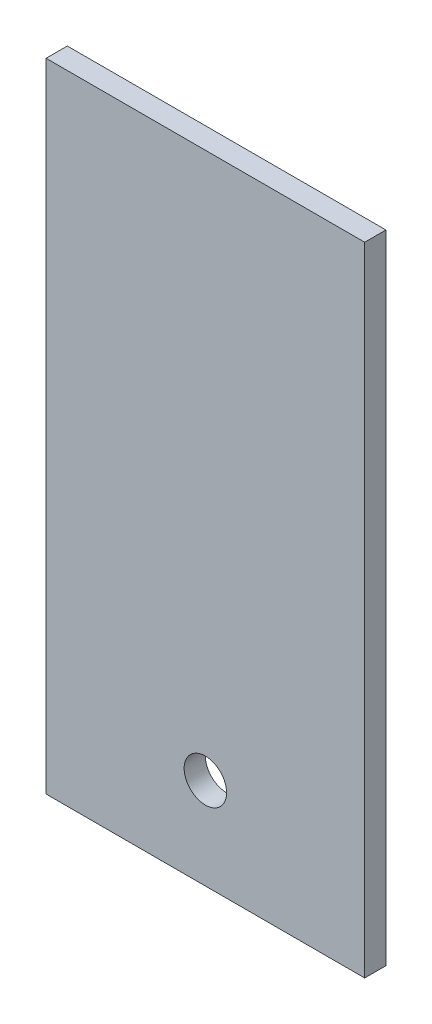
ISO-10303-21;
HEADER;
FILE_DESCRIPTION(('STEP AP214'),'2;1');
FILE_NAME('part.step','',(''),(''),'','','');
FILE_SCHEMA(('AUTOMOTIVE_DESIGN { 1 0 10303 214 1 1 1 1 }'));
ENDSEC;
DATA;
#1=APPLICATION_CONTEXT('core data for automotive mechanical design processes');
#2=APPLICATION_PROTOCOL_DEFINITION('international standard','automotive_design',2000,#1);
#3=PRODUCT_CONTEXT('',#1,'mechanical');
#4=PRODUCT('Part','Part','',(#3));
#5=PRODUCT_RELATED_PRODUCT_CATEGORY('part','',(#4));
#6=PRODUCT_DEFINITION_FORMATION('','',#4);
#7=PRODUCT_DEFINITION_CONTEXT('part definition',#1,'design');
#8=PRODUCT_DEFINITION('design','',#6,#7);
#9=PRODUCT_DEFINITION_SHAPE('','',#8);
#10=(LENGTH_UNIT() NAMED_UNIT(*) SI_UNIT(.MILLI.,.METRE.));
#11=(NAMED_UNIT(*) PLANE_ANGLE_UNIT() SI_UNIT($,.RADIAN.));
#12=(NAMED_UNIT(*) SI_UNIT($,.STERADIAN.) SOLID_ANGLE_UNIT());
#13=UNCERTAINTY_MEASURE_WITH_UNIT(LENGTH_MEASURE(1.E-05),#10,'distance_accuracy_value','');
#14=(GEOMETRIC_REPRESENTATION_CONTEXT(3) GLOBAL_UNCERTAINTY_ASSIGNED_CONTEXT((#13)) GLOBAL_UNIT_ASSIGNED_CONTEXT((#10,
#11,#12)) REPRESENTATION_CONTEXT('',''));
#15=CARTESIAN_POINT('',(0.,0.,0.));
#16=DIRECTION('',(0.,0.,1.));
#17=DIRECTION('',(1.,0.,0.));
#18=AXIS2_PLACEMENT_3D('',#15,#16,#17);
#19=CARTESIAN_POINT('',(0.,0.,10.));
#20=DIRECTION('',(0.,0.,1.));
#21=DIRECTION('',(1.,0.,0.));
#22=AXIS2_PLACEMENT_3D('',#19,#20,#21);
#23=PLANE('',#22);
#24=DIRECTION('',(0.,1.,0.));
#25=VECTOR('',#24,1.);
#26=CARTESIAN_POINT('',(75.,150.,10.));
#27=LINE('',#26,#25);
#28=CARTESIAN_POINT('',(75.,-150.,10.));
#29=VERTEX_POINT('',#28);
#30=CARTESIAN_POINT('',(75.,150.,10.));
#31=VERTEX_POINT('',#30);
#32=EDGE_CURVE('E95',#29,#31,#27,.T.);
#33=ORIENTED_EDGE('',*,*,#32,.T.);
#34=DIRECTION('',(-1.,0.,0.));
#35=VECTOR('',#34,1.);
#36=CARTESIAN_POINT('',(-75.,150.,10.));
#37=LINE('',#36,#35);
#38=CARTESIAN_POINT('',(-75.,150.,10.));
#39=VERTEX_POINT('',#38);
#40=EDGE_CURVE('E90',#31,#39,#37,.T.);
#41=ORIENTED_EDGE('',*,*,#40,.T.);
#42=DIRECTION('',(0.,-1.,0.));
#43=VECTOR('',#42,1.);
#44=CARTESIAN_POINT('',(-75.,150.,10.));
#45=LINE('',#44,#43);
#46=CARTESIAN_POINT('',(-75.,-150.,10.));
#47=VERTEX_POINT('',#46);
#48=EDGE_CURVE('E93',#39,#47,#45,.T.);
#49=ORIENTED_EDGE('',*,*,#48,.T.);
#50=DIRECTION('',(1.,0.,0.));
#51=VECTOR('',#50,1.);
#52=CARTESIAN_POINT('',(-75.,-150.,10.));
#53=LINE('',#52,#51);
#54=EDGE_CURVE('E60',#47,#29,#53,.T.);
#55=ORIENTED_EDGE('',*,*,#54,.T.);
#56=EDGE_LOOP('',(#33,#41,#49,#55));
#57=FACE_BOUND('',#56,.T.);
#58=CARTESIAN_POINT('',(0.,-107.,10.));
#59=DIRECTION('',(0.,0.,1.));
#60=DIRECTION('',(1.,0.,0.));
#61=AXIS2_PLACEMENT_3D('',#58,#59,#60);
#62=CIRCLE('',#61,10.);
#63=CARTESIAN_POINT('',(10.,-107.,10.));
#64=VERTEX_POINT('',#63);
#65=EDGE_CURVE('E180',#64,#64,#62,.T.);
#66=ORIENTED_EDGE('',*,*,#65,.F.);
#67=EDGE_LOOP('',(#66));
#68=FACE_BOUND('',#67,.T.);
#69=ADVANCED_FACE('F41',(#57,#68),#23,.T.);
#70=CARTESIAN_POINT('',(0.,0.,0.));
#71=DIRECTION('',(0.,0.,1.));
#72=DIRECTION('',(1.,0.,0.));
#73=AXIS2_PLACEMENT_3D('',#70,#71,#72);
#74=PLANE('',#73);
#75=DIRECTION('',(0.,1.,0.));
#76=VECTOR('',#75,1.);
#77=CARTESIAN_POINT('',(75.,150.,0.));
#78=LINE('',#77,#76);
#79=CARTESIAN_POINT('',(75.,-150.,0.));
#80=VERTEX_POINT('',#79);
#81=CARTESIAN_POINT('',(75.,150.,0.));
#82=VERTEX_POINT('',#81);
#83=EDGE_CURVE('E167',#80,#82,#78,.T.);
#84=ORIENTED_EDGE('',*,*,#83,.F.);
#85=DIRECTION('',(1.,0.,0.));
#86=VECTOR('',#85,1.);
#87=CARTESIAN_POINT('',(-75.,-150.,0.));
#88=LINE('',#87,#86);
#89=CARTESIAN_POINT('',(-75.,-150.,0.));
#90=VERTEX_POINT('',#89);
#91=EDGE_CURVE('E83',#90,#80,#88,.T.);
#92=ORIENTED_EDGE('',*,*,#91,.F.);
#93=DIRECTION('',(0.,-1.,0.));
#94=VECTOR('',#93,1.);
#95=CARTESIAN_POINT('',(-75.,150.,0.));
#96=LINE('',#95,#94);
#97=CARTESIAN_POINT('',(-75.,150.,0.));
#98=VERTEX_POINT('',#97);
#99=EDGE_CURVE('E77',#98,#90,#96,.T.);
#100=ORIENTED_EDGE('',*,*,#99,.F.);
#101=DIRECTION('',(-1.,0.,0.));
#102=VECTOR('',#101,1.);
#103=CARTESIAN_POINT('',(-75.,150.,0.));
#104=LINE('',#103,#102);
#105=EDGE_CURVE('E100',#82,#98,#104,.T.);
#106=ORIENTED_EDGE('',*,*,#105,.F.);
#107=EDGE_LOOP('',(#84,#92,#100,#106));
#108=FACE_BOUND('',#107,.T.);
#109=CARTESIAN_POINT('',(0.,-107.,0.));
#110=DIRECTION('',(0.,0.,1.));
#111=DIRECTION('',(1.,0.,0.));
#112=AXIS2_PLACEMENT_3D('',#109,#110,#111);
#113=CIRCLE('',#112,10.);
#114=CARTESIAN_POINT('',(10.,-107.,0.));
#115=VERTEX_POINT('',#114);
#116=EDGE_CURVE('E135',#115,#115,#113,.T.);
#117=ORIENTED_EDGE('',*,*,#116,.T.);
#118=EDGE_LOOP('',(#117));
#119=FACE_BOUND('',#118,.T.);
#120=ADVANCED_FACE('F222',(#108,#119),#74,.F.);
#121=CARTESIAN_POINT('',(75.,150.,10.));
#122=DIRECTION('',(-1.,0.,0.));
#123=DIRECTION('',(0.,-1.,0.));
#124=AXIS2_PLACEMENT_3D('',#121,#122,#123);
#125=PLANE('',#124);
#126=ORIENTED_EDGE('',*,*,#83,.T.);
#127=DIRECTION('',(0.,0.,-1.));
#128=VECTOR('',#127,1.);
#129=CARTESIAN_POINT('',(75.,150.,10.));
#130=LINE('',#129,#128);
#131=EDGE_CURVE('E12',#31,#82,#130,.T.);
#132=ORIENTED_EDGE('',*,*,#131,.F.);
#133=ORIENTED_EDGE('',*,*,#32,.F.);
#134=DIRECTION('',(0.,0.,-1.));
#135=VECTOR('',#134,1.);
#136=CARTESIAN_POINT('',(75.,-150.,10.));
#137=LINE('',#136,#135);
#138=EDGE_CURVE('E108',#29,#80,#137,.T.);
#139=ORIENTED_EDGE('',*,*,#138,.T.);
#140=EDGE_LOOP('',(#126,#132,#133,#139));
#141=FACE_BOUND('',#140,.T.);
#142=ADVANCED_FACE('F43',(#141),#125,.F.);
#143=CARTESIAN_POINT('',(-75.,150.,10.));
#144=DIRECTION('',(0.,-1.,0.));
#145=DIRECTION('',(0.,0.,-1.));
#146=AXIS2_PLACEMENT_3D('',#143,#144,#145);
#147=PLANE('',#146);
#148=ORIENTED_EDGE('',*,*,#105,.T.);
#149=DIRECTION('',(0.,0.,-1.));
#150=VECTOR('',#149,1.);
#151=CARTESIAN_POINT('',(-75.,150.,10.));
#152=LINE('',#151,#150);
#153=EDGE_CURVE('E52',#39,#98,#152,.T.);
#154=ORIENTED_EDGE('',*,*,#153,.F.);
#155=ORIENTED_EDGE('',*,*,#40,.F.);
#156=ORIENTED_EDGE('',*,*,#131,.T.);
#157=EDGE_LOOP('',(#148,#154,#155,#156));
#158=FACE_BOUND('',#157,.T.);
#159=ADVANCED_FACE('F99',(#158),#147,.F.);
#160=CARTESIAN_POINT('',(-75.,150.,10.));
#161=DIRECTION('',(1.,0.,0.));
#162=DIRECTION('',(0.,1.,0.));
#163=AXIS2_PLACEMENT_3D('',#160,#161,#162);
#164=PLANE('',#163);
#165=ORIENTED_EDGE('',*,*,#99,.T.);
#166=DIRECTION('',(0.,0.,-1.));
#167=VECTOR('',#166,1.);
#168=CARTESIAN_POINT('',(-75.,-150.,10.));
#169=LINE('',#168,#167);
#170=EDGE_CURVE('E102',#47,#90,#169,.T.);
#171=ORIENTED_EDGE('',*,*,#170,.F.);
#172=ORIENTED_EDGE('',*,*,#48,.F.);
#173=ORIENTED_EDGE('',*,*,#153,.T.);
#174=EDGE_LOOP('',(#165,#171,#172,#173));
#175=FACE_BOUND('',#174,.T.);
#176=ADVANCED_FACE('F103',(#175),#164,.F.);
#177=CARTESIAN_POINT('',(-75.,-150.,10.));
#178=DIRECTION('',(0.,1.,0.));
#179=DIRECTION('',(0.,0.,1.));
#180=AXIS2_PLACEMENT_3D('',#177,#178,#179);
#181=PLANE('',#180);
#182=ORIENTED_EDGE('',*,*,#91,.T.);
#183=ORIENTED_EDGE('',*,*,#138,.F.);
#184=ORIENTED_EDGE('',*,*,#54,.F.);
#185=ORIENTED_EDGE('',*,*,#170,.T.);
#186=EDGE_LOOP('',(#182,#183,#184,#185));
#187=FACE_BOUND('',#186,.T.);
#188=ADVANCED_FACE('F271',(#187),#181,.F.);
#189=CARTESIAN_POINT('',(0.,-107.,10.));
#190=DIRECTION('',(0.,0.,-1.));
#191=DIRECTION('',(-1.,0.,0.));
#192=AXIS2_PLACEMENT_3D('',#189,#190,#191);
#193=CYLINDRICAL_SURFACE('',#192,10.);
#194=ORIENTED_EDGE('',*,*,#65,.T.);
#195=EDGE_LOOP('',(#194));
#196=FACE_BOUND('',#195,.T.);
#197=ORIENTED_EDGE('',*,*,#116,.F.);
#198=EDGE_LOOP('',(#197));
#199=FACE_BOUND('',#198,.T.);
#200=ADVANCED_FACE('F269',(#196,#199),#193,.F.);
#201=CLOSED_SHELL('',(#69,#120,#142,#159,#176,#188,#200));
#202=MANIFOLD_SOLID_BREP('B2',#201);
#203=ADVANCED_BREP_SHAPE_REPRESENTATION('',(#18,#202),#14);
#204=SHAPE_DEFINITION_REPRESENTATION(#9,#203);
ENDSEC;
END-ISO-10303-21;
